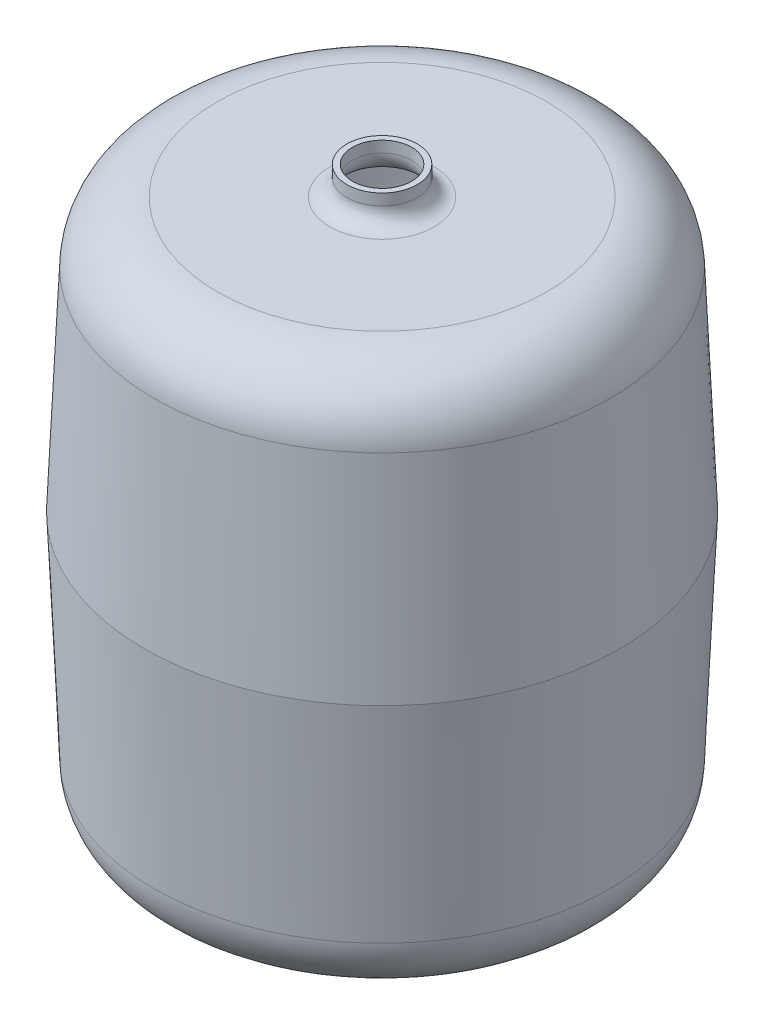
ISO-10303-21;
HEADER;
FILE_DESCRIPTION(('STEP AP214'),'2;1');
FILE_NAME('part.step','',(''),(''),'','','');
FILE_SCHEMA(('AUTOMOTIVE_DESIGN { 1 0 10303 214 1 1 1 1 }'));
ENDSEC;
DATA;
#1=APPLICATION_CONTEXT('core data for automotive mechanical design processes');
#2=APPLICATION_PROTOCOL_DEFINITION('international standard','automotive_design',2000,#1);
#3=PRODUCT_CONTEXT('',#1,'mechanical');
#4=PRODUCT('Part','Part','',(#3));
#5=PRODUCT_RELATED_PRODUCT_CATEGORY('part','',(#4));
#6=PRODUCT_DEFINITION_FORMATION('','',#4);
#7=PRODUCT_DEFINITION_CONTEXT('part definition',#1,'design');
#8=PRODUCT_DEFINITION('design','',#6,#7);
#9=PRODUCT_DEFINITION_SHAPE('','',#8);
#10=(LENGTH_UNIT() NAMED_UNIT(*) SI_UNIT(.MILLI.,.METRE.));
#11=(NAMED_UNIT(*) PLANE_ANGLE_UNIT() SI_UNIT($,.RADIAN.));
#12=(NAMED_UNIT(*) SI_UNIT($,.STERADIAN.) SOLID_ANGLE_UNIT());
#13=UNCERTAINTY_MEASURE_WITH_UNIT(LENGTH_MEASURE(1.E-05),#10,'distance_accuracy_value','');
#14=(GEOMETRIC_REPRESENTATION_CONTEXT(3) GLOBAL_UNCERTAINTY_ASSIGNED_CONTEXT((#13)) GLOBAL_UNIT_ASSIGNED_CONTEXT((#10,
#11,#12)) REPRESENTATION_CONTEXT('',''));
#15=CARTESIAN_POINT('',(0.,0.,0.));
#16=DIRECTION('',(0.,0.,1.));
#17=DIRECTION('',(1.,0.,0.));
#18=AXIS2_PLACEMENT_3D('',#15,#16,#17);
#19=CARTESIAN_POINT('',(0.,579.019102,0.));
#20=DIRECTION('',(0.,1.,0.));
#21=DIRECTION('',(-1.,0.,0.));
#22=AXIS2_PLACEMENT_3D('',#19,#20,#21);
#23=CYLINDRICAL_SURFACE('',#22,21.);
#24=CARTESIAN_POINT('',(0.,399.5,0.));
#25=DIRECTION('',(0.,1.,0.));
#26=DIRECTION('',(-1.,0.,0.));
#27=AXIS2_PLACEMENT_3D('',#24,#25,#26);
#28=CIRCLE('',#27,21.);
#29=CARTESIAN_POINT('',(-21.,399.5,0.));
#30=VERTEX_POINT('',#29);
#31=EDGE_CURVE('E83',#30,#30,#28,.T.);
#32=ORIENTED_EDGE('',*,*,#31,.F.);
#33=EDGE_LOOP('',(#32));
#34=FACE_BOUND('',#33,.T.);
#35=CARTESIAN_POINT('',(0.,407.5,0.));
#36=DIRECTION('',(0.,1.,0.));
#37=DIRECTION('',(-1.,0.,0.));
#38=AXIS2_PLACEMENT_3D('',#35,#36,#37);
#39=CIRCLE('',#38,21.);
#40=CARTESIAN_POINT('',(-21.,407.5,0.));
#41=VERTEX_POINT('',#40);
#42=EDGE_CURVE('E111',#41,#41,#39,.T.);
#43=ORIENTED_EDGE('',*,*,#42,.T.);
#44=EDGE_LOOP('',(#43));
#45=FACE_BOUND('',#44,.T.);
#46=ADVANCED_FACE('F43',(#34,#45),#23,.F.);
#47=CARTESIAN_POINT('',(0.,399.5,0.));
#48=DIRECTION('',(0.,1.,0.));
#49=DIRECTION('',(-1.,0.,0.));
#50=AXIS2_PLACEMENT_3D('',#47,#48,#49);
#51=TOROIDAL_SURFACE('',#50,37.,16.);
#52=CARTESIAN_POINT('',(0.,383.5,0.));
#53=DIRECTION('',(0.,1.,0.));
#54=DIRECTION('',(-1.,0.,0.));
#55=AXIS2_PLACEMENT_3D('',#52,#53,#54);
#56=CIRCLE('',#55,37.0000000000001);
#57=CARTESIAN_POINT('',(-37.0000000000001,383.5,0.));
#58=VERTEX_POINT('',#57);
#59=EDGE_CURVE('E87',#58,#58,#56,.T.);
#60=ORIENTED_EDGE('',*,*,#59,.F.);
#61=EDGE_LOOP('',(#60));
#62=FACE_BOUND('',#61,.T.);
#63=ORIENTED_EDGE('',*,*,#31,.T.);
#64=EDGE_LOOP('',(#63));
#65=FACE_BOUND('',#64,.T.);
#66=ADVANCED_FACE('F162',(#62,#65),#51,.T.);
#67=CARTESIAN_POINT('',(116.921871598533,383.5,0.));
#68=DIRECTION('',(0.,1.,0.));
#69=DIRECTION('',(-1.,0.,0.));
#70=AXIS2_PLACEMENT_3D('',#67,#68,#69);
#71=PLANE('',#70);
#72=CARTESIAN_POINT('',(0.,383.5,0.));
#73=DIRECTION('',(0.,1.,0.));
#74=DIRECTION('',(-1.,0.,0.));
#75=AXIS2_PLACEMENT_3D('',#72,#73,#74);
#76=CIRCLE('',#75,116.921871598533);
#77=CARTESIAN_POINT('',(-116.921871598533,383.5,0.));
#78=VERTEX_POINT('',#77);
#79=EDGE_CURVE('E91',#78,#78,#76,.T.);
#80=ORIENTED_EDGE('',*,*,#79,.F.);
#81=EDGE_LOOP('',(#80));
#82=FACE_BOUND('',#81,.T.);
#83=ORIENTED_EDGE('',*,*,#59,.T.);
#84=EDGE_LOOP('',(#83));
#85=FACE_BOUND('',#84,.T.);
#86=ADVANCED_FACE('F169',(#82,#85),#71,.F.);
#87=CARTESIAN_POINT('',(0.,342.5,0.));
#88=DIRECTION('',(0.,1.,0.));
#89=DIRECTION('',(-1.,0.,0.));
#90=AXIS2_PLACEMENT_3D('',#87,#88,#89);
#91=TOROIDAL_SURFACE('',#90,116.921871598533,41.);
#92=CARTESIAN_POINT('',(0.,344.288394881978,0.));
#93=DIRECTION('',(0.,1.,0.));
#94=DIRECTION('',(-1.,0.,0.));
#95=AXIS2_PLACEMENT_3D('',#92,#93,#94);
#96=CIRCLE('',#95,157.88284868339);
#97=CARTESIAN_POINT('',(-157.88284868339,344.288394881978,0.));
#98=VERTEX_POINT('',#97);
#99=EDGE_CURVE('E95',#98,#98,#96,.T.);
#100=ORIENTED_EDGE('',*,*,#99,.F.);
#101=EDGE_LOOP('',(#100));
#102=FACE_BOUND('',#101,.T.);
#103=ORIENTED_EDGE('',*,*,#79,.T.);
#104=EDGE_LOOP('',(#103));
#105=FACE_BOUND('',#104,.T.);
#106=ADVANCED_FACE('F176',(#102,#105),#91,.F.);
#107=CARTESIAN_POINT('',(0.,344.288394881978,0.));
#108=DIRECTION('',(0.,-1.,0.));
#109=DIRECTION('',(1.,0.,0.));
#110=AXIS2_PLACEMENT_3D('',#107,#108,#109);
#111=CONICAL_SURFACE('',#110,157.88284868339,0.0436332312998548);
#112=CARTESIAN_POINT('',(0.,193.75,0.));
#113=DIRECTION('',(0.,1.,0.));
#114=DIRECTION('',(-1.,0.,0.));
#115=AXIS2_PLACEMENT_3D('',#112,#113,#114);
#116=CIRCLE('',#115,164.45549694787);
#117=CARTESIAN_POINT('',(-164.45549694787,193.75,0.));
#118=VERTEX_POINT('',#117);
#119=EDGE_CURVE('E99',#118,#118,#116,.T.);
#120=ORIENTED_EDGE('',*,*,#119,.F.);
#121=EDGE_LOOP('',(#120));
#122=FACE_BOUND('',#121,.T.);
#123=ORIENTED_EDGE('',*,*,#99,.T.);
#124=EDGE_LOOP('',(#123));
#125=FACE_BOUND('',#124,.T.);
#126=ADVANCED_FACE('F180',(#122,#125),#111,.F.);
#127=CARTESIAN_POINT('',(0.,193.75,0.));
#128=DIRECTION('',(0.,1.,0.));
#129=DIRECTION('',(-1.,0.,0.));
#130=AXIS2_PLACEMENT_3D('',#127,#128,#129);
#131=CONICAL_SURFACE('',#130,164.45549694787,0.0436332312998542);
#132=CARTESIAN_POINT('',(0.,43.2116051180214,0.));
#133=DIRECTION('',(0.,1.,0.));
#134=DIRECTION('',(-1.,0.,0.));
#135=AXIS2_PLACEMENT_3D('',#132,#133,#134);
#136=CIRCLE('',#135,157.88284868339);
#137=CARTESIAN_POINT('',(-157.88284868339,43.2116051180214,0.));
#138=VERTEX_POINT('',#137);
#139=EDGE_CURVE('E103',#138,#138,#136,.T.);
#140=ORIENTED_EDGE('',*,*,#139,.F.);
#141=EDGE_LOOP('',(#140));
#142=FACE_BOUND('',#141,.T.);
#143=ORIENTED_EDGE('',*,*,#119,.T.);
#144=EDGE_LOOP('',(#143));
#145=FACE_BOUND('',#144,.T.);
#146=ADVANCED_FACE('F184',(#142,#145),#131,.F.);
#147=CARTESIAN_POINT('',(0.,45.,0.));
#148=DIRECTION('',(0.,1.,0.));
#149=DIRECTION('',(-1.,0.,0.));
#150=AXIS2_PLACEMENT_3D('',#147,#148,#149);
#151=TOROIDAL_SURFACE('',#150,116.921871598533,41.);
#152=CARTESIAN_POINT('',(0.,4.,0.));
#153=DIRECTION('',(0.,1.,0.));
#154=DIRECTION('',(-1.,0.,0.));
#155=AXIS2_PLACEMENT_3D('',#152,#153,#154);
#156=CIRCLE('',#155,116.921871598533);
#157=CARTESIAN_POINT('',(-116.921871598533,4.,0.));
#158=VERTEX_POINT('',#157);
#159=EDGE_CURVE('E107',#158,#158,#156,.T.);
#160=ORIENTED_EDGE('',*,*,#159,.F.);
#161=EDGE_LOOP('',(#160));
#162=FACE_BOUND('',#161,.T.);
#163=ORIENTED_EDGE('',*,*,#139,.T.);
#164=EDGE_LOOP('',(#163));
#165=FACE_BOUND('',#164,.T.);
#166=ADVANCED_FACE('F188',(#162,#165),#151,.F.);
#167=CARTESIAN_POINT('',(0.,3.99999999999999,0.));
#168=DIRECTION('',(0.,-1.,0.));
#169=DIRECTION('',(1.,0.,0.));
#170=AXIS2_PLACEMENT_3D('',#167,#168,#169);
#171=PLANE('',#170);
#172=ORIENTED_EDGE('',*,*,#159,.T.);
#173=EDGE_LOOP('',(#172));
#174=FACE_BOUND('',#173,.T.);
#175=ADVANCED_FACE('F192',(#174),#171,.F.);
#176=CARTESIAN_POINT('',(0.,0.,0.));
#177=DIRECTION('',(0.,1.,0.));
#178=DIRECTION('',(-1.,0.,0.));
#179=AXIS2_PLACEMENT_3D('',#176,#177,#178);
#180=PLANE('',#179);
#181=CARTESIAN_POINT('',(0.,0.,0.));
#182=DIRECTION('',(0.,1.,0.));
#183=DIRECTION('',(-1.,0.,0.));
#184=AXIS2_PLACEMENT_3D('',#181,#182,#183);
#185=CIRCLE('',#184,116.921871598533);
#186=CARTESIAN_POINT('',(-116.921871598533,0.,0.));
#187=VERTEX_POINT('',#186);
#188=EDGE_CURVE('E10',#187,#187,#185,.T.);
#189=ORIENTED_EDGE('',*,*,#188,.F.);
#190=EDGE_LOOP('',(#189));
#191=FACE_BOUND('',#190,.T.);
#192=ADVANCED_FACE('F45',(#191),#180,.F.);
#193=CARTESIAN_POINT('',(0.,45.,0.));
#194=DIRECTION('',(0.,1.,0.));
#195=DIRECTION('',(-1.,0.,0.));
#196=AXIS2_PLACEMENT_3D('',#193,#194,#195);
#197=TOROIDAL_SURFACE('',#196,116.921871598533,45.);
#198=CARTESIAN_POINT('',(0.,43.03712756856,0.));
#199=DIRECTION('',(0.,1.,0.));
#200=DIRECTION('',(-1.,0.,0.));
#201=AXIS2_PLACEMENT_3D('',#198,#199,#200);
#202=CIRCLE('',#201,161.879041569717);
#203=CARTESIAN_POINT('',(-161.879041569717,43.03712756856,0.));
#204=VERTEX_POINT('',#203);
#205=EDGE_CURVE('E51',#204,#204,#202,.T.);
#206=ORIENTED_EDGE('',*,*,#205,.F.);
#207=EDGE_LOOP('',(#206));
#208=FACE_BOUND('',#207,.T.);
#209=ORIENTED_EDGE('',*,*,#188,.T.);
#210=EDGE_LOOP('',(#209));
#211=FACE_BOUND('',#210,.T.);
#212=ADVANCED_FACE('F155',(#208,#211),#197,.T.);
#213=CARTESIAN_POINT('',(0.,43.03712756856,0.));
#214=DIRECTION('',(0.,1.,0.));
#215=DIRECTION('',(-1.,0.,0.));
#216=AXIS2_PLACEMENT_3D('',#213,#214,#215);
#217=CONICAL_SURFACE('',#216,161.879041569717,0.0436332312998544);
#218=CARTESIAN_POINT('',(0.,193.75,0.));
#219=DIRECTION('',(0.,1.,0.));
#220=DIRECTION('',(-1.,0.,0.));
#221=AXIS2_PLACEMENT_3D('',#218,#219,#220);
#222=CIRCLE('',#221,168.459307688523);
#223=CARTESIAN_POINT('',(-168.459307688523,193.75,0.));
#224=VERTEX_POINT('',#223);
#225=EDGE_CURVE('E56',#224,#224,#222,.T.);
#226=ORIENTED_EDGE('',*,*,#225,.F.);
#227=EDGE_LOOP('',(#226));
#228=FACE_BOUND('',#227,.T.);
#229=ORIENTED_EDGE('',*,*,#205,.T.);
#230=EDGE_LOOP('',(#229));
#231=FACE_BOUND('',#230,.T.);
#232=ADVANCED_FACE('F150',(#228,#231),#217,.T.);
#233=CARTESIAN_POINT('',(0.,193.75,0.));
#234=DIRECTION('',(0.,-1.,0.));
#235=DIRECTION('',(1.,0.,0.));
#236=AXIS2_PLACEMENT_3D('',#233,#234,#235);
#237=CONICAL_SURFACE('',#236,168.459307688523,0.0436332312998548);
#238=CARTESIAN_POINT('',(0.,344.46287243144,0.));
#239=DIRECTION('',(0.,1.,0.));
#240=DIRECTION('',(-1.,0.,0.));
#241=AXIS2_PLACEMENT_3D('',#238,#239,#240);
#242=CIRCLE('',#241,161.879041569717);
#243=CARTESIAN_POINT('',(-161.879041569717,344.46287243144,0.));
#244=VERTEX_POINT('',#243);
#245=EDGE_CURVE('E61',#244,#244,#242,.T.);
#246=ORIENTED_EDGE('',*,*,#245,.F.);
#247=EDGE_LOOP('',(#246));
#248=FACE_BOUND('',#247,.T.);
#249=ORIENTED_EDGE('',*,*,#225,.T.);
#250=EDGE_LOOP('',(#249));
#251=FACE_BOUND('',#250,.T.);
#252=ADVANCED_FACE('F144',(#248,#251),#237,.T.);
#253=CARTESIAN_POINT('',(0.,342.5,0.));
#254=DIRECTION('',(0.,1.,0.));
#255=DIRECTION('',(-1.,0.,0.));
#256=AXIS2_PLACEMENT_3D('',#253,#254,#255);
#257=TOROIDAL_SURFACE('',#256,116.921871598533,45.);
#258=CARTESIAN_POINT('',(0.,387.5,0.));
#259=DIRECTION('',(0.,1.,0.));
#260=DIRECTION('',(-1.,0.,0.));
#261=AXIS2_PLACEMENT_3D('',#258,#259,#260);
#262=CIRCLE('',#261,116.921871598533);
#263=CARTESIAN_POINT('',(-116.921871598533,387.5,0.));
#264=VERTEX_POINT('',#263);
#265=EDGE_CURVE('E67',#264,#264,#262,.T.);
#266=ORIENTED_EDGE('',*,*,#265,.F.);
#267=EDGE_LOOP('',(#266));
#268=FACE_BOUND('',#267,.T.);
#269=ORIENTED_EDGE('',*,*,#245,.T.);
#270=EDGE_LOOP('',(#269));
#271=FACE_BOUND('',#270,.T.);
#272=ADVANCED_FACE('F138',(#268,#271),#257,.T.);
#273=CARTESIAN_POINT('',(116.921871598533,387.5,0.));
#274=DIRECTION('',(0.,-1.,0.));
#275=DIRECTION('',(1.,0.,0.));
#276=AXIS2_PLACEMENT_3D('',#273,#274,#275);
#277=PLANE('',#276);
#278=CARTESIAN_POINT('',(0.,387.5,0.));
#279=DIRECTION('',(0.,1.,0.));
#280=DIRECTION('',(-1.,0.,0.));
#281=AXIS2_PLACEMENT_3D('',#278,#279,#280);
#282=CIRCLE('',#281,37.0000000000001);
#283=CARTESIAN_POINT('',(-37.0000000000001,387.5,0.));
#284=VERTEX_POINT('',#283);
#285=EDGE_CURVE('E71',#284,#284,#282,.T.);
#286=ORIENTED_EDGE('',*,*,#285,.F.);
#287=EDGE_LOOP('',(#286));
#288=FACE_BOUND('',#287,.T.);
#289=ORIENTED_EDGE('',*,*,#265,.T.);
#290=EDGE_LOOP('',(#289));
#291=FACE_BOUND('',#290,.T.);
#292=ADVANCED_FACE('F132',(#288,#291),#277,.F.);
#293=CARTESIAN_POINT('',(0.,399.5,0.));
#294=DIRECTION('',(0.,1.,0.));
#295=DIRECTION('',(-1.,0.,0.));
#296=AXIS2_PLACEMENT_3D('',#293,#294,#295);
#297=TOROIDAL_SURFACE('',#296,37.,12.);
#298=CARTESIAN_POINT('',(0.,399.5,0.));
#299=DIRECTION('',(0.,1.,0.));
#300=DIRECTION('',(-1.,0.,0.));
#301=AXIS2_PLACEMENT_3D('',#298,#299,#300);
#302=CIRCLE('',#301,25.);
#303=CARTESIAN_POINT('',(-25.,399.5,0.));
#304=VERTEX_POINT('',#303);
#305=EDGE_CURVE('E75',#304,#304,#302,.T.);
#306=ORIENTED_EDGE('',*,*,#305,.F.);
#307=EDGE_LOOP('',(#306));
#308=FACE_BOUND('',#307,.T.);
#309=ORIENTED_EDGE('',*,*,#285,.T.);
#310=EDGE_LOOP('',(#309));
#311=FACE_BOUND('',#310,.T.);
#312=ADVANCED_FACE('F126',(#308,#311),#297,.F.);
#313=CARTESIAN_POINT('',(0.,579.019102,0.));
#314=DIRECTION('',(0.,1.,0.));
#315=DIRECTION('',(-1.,0.,0.));
#316=AXIS2_PLACEMENT_3D('',#313,#314,#315);
#317=CYLINDRICAL_SURFACE('',#316,25.);
#318=CARTESIAN_POINT('',(0.,407.5,0.));
#319=DIRECTION('',(0.,1.,0.));
#320=DIRECTION('',(-1.,0.,0.));
#321=AXIS2_PLACEMENT_3D('',#318,#319,#320);
#322=CIRCLE('',#321,25.);
#323=CARTESIAN_POINT('',(-25.,407.5,0.));
#324=VERTEX_POINT('',#323);
#325=EDGE_CURVE('E79',#324,#324,#322,.T.);
#326=ORIENTED_EDGE('',*,*,#325,.F.);
#327=EDGE_LOOP('',(#326));
#328=FACE_BOUND('',#327,.T.);
#329=ORIENTED_EDGE('',*,*,#305,.T.);
#330=EDGE_LOOP('',(#329));
#331=FACE_BOUND('',#330,.T.);
#332=ADVANCED_FACE('F120',(#328,#331),#317,.T.);
#333=CARTESIAN_POINT('',(0.,407.5,0.));
#334=DIRECTION('',(0.,-1.,0.));
#335=DIRECTION('',(1.,0.,0.));
#336=AXIS2_PLACEMENT_3D('',#333,#334,#335);
#337=PLANE('',#336);
#338=ORIENTED_EDGE('',*,*,#42,.F.);
#339=EDGE_LOOP('',(#338));
#340=FACE_BOUND('',#339,.T.);
#341=ORIENTED_EDGE('',*,*,#325,.T.);
#342=EDGE_LOOP('',(#341));
#343=FACE_BOUND('',#342,.T.);
#344=ADVANCED_FACE('F117',(#340,#343),#337,.F.);
#345=CLOSED_SHELL('',(#46,#66,#86,#106,#126,#146,#166,#175,#192,#212,#232,#252,#272,#292,#312,
#332,#344));
#346=MANIFOLD_SOLID_BREP('B2',#345);
#347=ADVANCED_BREP_SHAPE_REPRESENTATION('',(#18,#346),#14);
#348=SHAPE_DEFINITION_REPRESENTATION(#9,#347);
ENDSEC;
END-ISO-10303-21;
